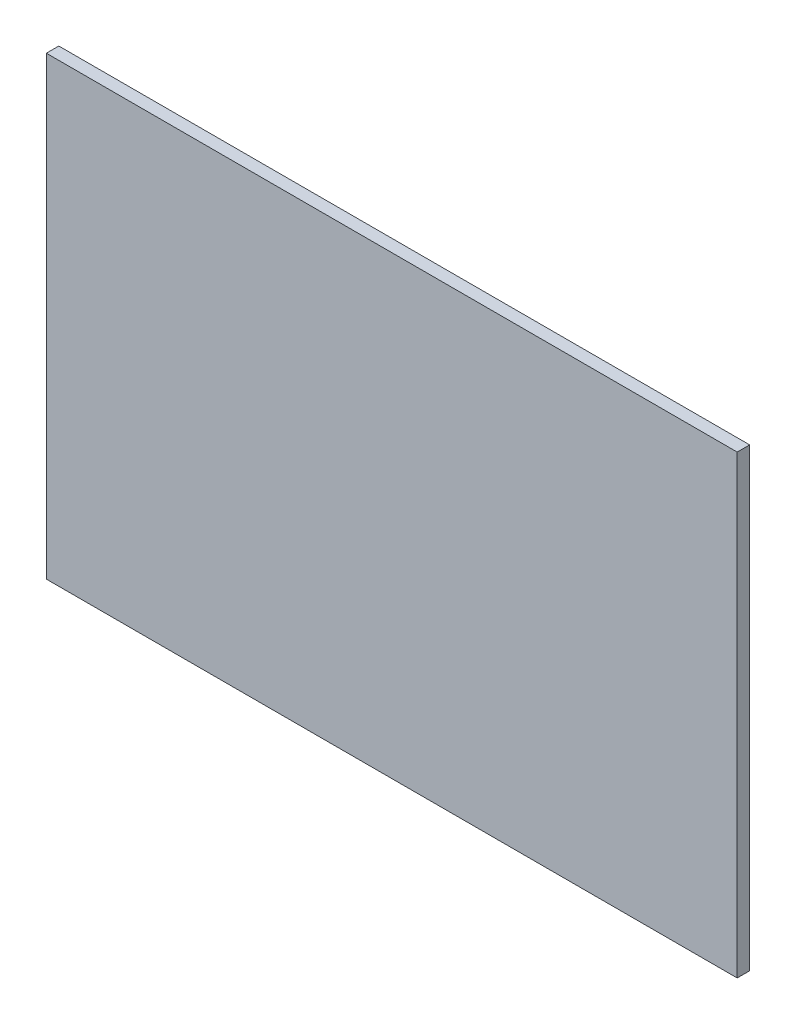
ISO-10303-21;
HEADER;
FILE_DESCRIPTION(('STEP AP214'),'2;1');
FILE_NAME('part.step','',(''),(''),'','','');
FILE_SCHEMA(('AUTOMOTIVE_DESIGN { 1 0 10303 214 1 1 1 1 }'));
ENDSEC;
DATA;
#1=APPLICATION_CONTEXT('core data for automotive mechanical design processes');
#2=APPLICATION_PROTOCOL_DEFINITION('international standard','automotive_design',2000,#1);
#3=PRODUCT_CONTEXT('',#1,'mechanical');
#4=PRODUCT('Part','Part','',(#3));
#5=PRODUCT_RELATED_PRODUCT_CATEGORY('part','',(#4));
#6=PRODUCT_DEFINITION_FORMATION('','',#4);
#7=PRODUCT_DEFINITION_CONTEXT('part definition',#1,'design');
#8=PRODUCT_DEFINITION('design','',#6,#7);
#9=PRODUCT_DEFINITION_SHAPE('','',#8);
#10=(LENGTH_UNIT() NAMED_UNIT(*) SI_UNIT(.MILLI.,.METRE.));
#11=(NAMED_UNIT(*) PLANE_ANGLE_UNIT() SI_UNIT($,.RADIAN.));
#12=(NAMED_UNIT(*) SI_UNIT($,.STERADIAN.) SOLID_ANGLE_UNIT());
#13=UNCERTAINTY_MEASURE_WITH_UNIT(LENGTH_MEASURE(1.E-05),#10,'distance_accuracy_value','');
#14=(GEOMETRIC_REPRESENTATION_CONTEXT(3) GLOBAL_UNCERTAINTY_ASSIGNED_CONTEXT((#13)) GLOBAL_UNIT_ASSIGNED_CONTEXT((#10,
#11,#12)) REPRESENTATION_CONTEXT('',''));
#15=CARTESIAN_POINT('',(0.,0.,0.));
#16=DIRECTION('',(0.,0.,1.));
#17=DIRECTION('',(1.,0.,0.));
#18=AXIS2_PLACEMENT_3D('',#15,#16,#17);
#19=CARTESIAN_POINT('',(0.,60.325,1.65));
#20=DIRECTION('',(0.,1.,0.));
#21=DIRECTION('',(-1.,0.,0.));
#22=AXIS2_PLACEMENT_3D('',#19,#20,#21);
#23=PLANE('',#22);
#24=DIRECTION('',(1.,0.,0.));
#25=VECTOR('',#24,1.);
#26=CARTESIAN_POINT('',(0.,60.325,0.));
#27=LINE('',#26,#25);
#28=CARTESIAN_POINT('',(0.,60.325,0.));
#29=VERTEX_POINT('',#28);
#30=CARTESIAN_POINT('',(91.5,60.325,0.));
#31=VERTEX_POINT('',#30);
#32=EDGE_CURVE('E98',#29,#31,#27,.T.);
#33=ORIENTED_EDGE('',*,*,#32,.F.);
#34=DIRECTION('',(0.,0.,-1.));
#35=VECTOR('',#34,1.);
#36=CARTESIAN_POINT('',(0.,60.325,1.65));
#37=LINE('',#36,#35);
#38=CARTESIAN_POINT('',(0.,60.325,1.65));
#39=VERTEX_POINT('',#38);
#40=EDGE_CURVE('E11',#39,#29,#37,.T.);
#41=ORIENTED_EDGE('',*,*,#40,.F.);
#42=DIRECTION('',(1.,0.,0.));
#43=VECTOR('',#42,1.);
#44=CARTESIAN_POINT('',(0.,60.325,1.65));
#45=LINE('',#44,#43);
#46=CARTESIAN_POINT('',(91.5,60.325,1.65));
#47=VERTEX_POINT('',#46);
#48=EDGE_CURVE('E92',#39,#47,#45,.T.);
#49=ORIENTED_EDGE('',*,*,#48,.T.);
#50=DIRECTION('',(0.,0.,-1.));
#51=VECTOR('',#50,1.);
#52=CARTESIAN_POINT('',(91.5,60.325,1.65));
#53=LINE('',#52,#51);
#54=EDGE_CURVE('E73',#47,#31,#53,.T.);
#55=ORIENTED_EDGE('',*,*,#54,.T.);
#56=EDGE_LOOP('',(#33,#41,#49,#55));
#57=FACE_BOUND('',#56,.T.);
#58=ADVANCED_FACE('F35',(#57),#23,.T.);
#59=CARTESIAN_POINT('',(0.,0.,1.65));
#60=DIRECTION('',(-1.,0.,0.));
#61=DIRECTION('',(0.,0.,1.));
#62=AXIS2_PLACEMENT_3D('',#59,#60,#61);
#63=PLANE('',#62);
#64=DIRECTION('',(0.,1.,0.));
#65=VECTOR('',#64,1.);
#66=CARTESIAN_POINT('',(0.,0.,0.));
#67=LINE('',#66,#65);
#68=CARTESIAN_POINT('',(0.,0.,0.));
#69=VERTEX_POINT('',#68);
#70=EDGE_CURVE('E86',#69,#29,#67,.T.);
#71=ORIENTED_EDGE('',*,*,#70,.F.);
#72=DIRECTION('',(0.,0.,-1.));
#73=VECTOR('',#72,1.);
#74=CARTESIAN_POINT('',(0.,0.,1.65));
#75=LINE('',#74,#73);
#76=CARTESIAN_POINT('',(0.,0.,1.65));
#77=VERTEX_POINT('',#76);
#78=EDGE_CURVE('E43',#77,#69,#75,.T.);
#79=ORIENTED_EDGE('',*,*,#78,.F.);
#80=DIRECTION('',(0.,1.,0.));
#81=VECTOR('',#80,1.);
#82=CARTESIAN_POINT('',(0.,0.,1.65));
#83=LINE('',#82,#81);
#84=EDGE_CURVE('E84',#77,#39,#83,.T.);
#85=ORIENTED_EDGE('',*,*,#84,.T.);
#86=ORIENTED_EDGE('',*,*,#40,.T.);
#87=EDGE_LOOP('',(#71,#79,#85,#86));
#88=FACE_BOUND('',#87,.T.);
#89=ADVANCED_FACE('F82',(#88),#63,.T.);
#90=CARTESIAN_POINT('',(0.,0.,1.65));
#91=DIRECTION('',(0.,1.,0.));
#92=DIRECTION('',(-1.,0.,0.));
#93=AXIS2_PLACEMENT_3D('',#90,#91,#92);
#94=PLANE('',#93);
#95=DIRECTION('',(1.,0.,0.));
#96=VECTOR('',#95,1.);
#97=CARTESIAN_POINT('',(0.,0.,0.));
#98=LINE('',#97,#96);
#99=CARTESIAN_POINT('',(91.5,0.,0.));
#100=VERTEX_POINT('',#99);
#101=EDGE_CURVE('E66',#69,#100,#98,.T.);
#102=ORIENTED_EDGE('',*,*,#101,.T.);
#103=DIRECTION('',(0.,0.,-1.));
#104=VECTOR('',#103,1.);
#105=CARTESIAN_POINT('',(91.5,0.,1.65));
#106=LINE('',#105,#104);
#107=CARTESIAN_POINT('',(91.5,0.,1.65));
#108=VERTEX_POINT('',#107);
#109=EDGE_CURVE('E87',#108,#100,#106,.T.);
#110=ORIENTED_EDGE('',*,*,#109,.F.);
#111=DIRECTION('',(1.,0.,0.));
#112=VECTOR('',#111,1.);
#113=CARTESIAN_POINT('',(0.,0.,1.65));
#114=LINE('',#113,#112);
#115=EDGE_CURVE('E88',#77,#108,#114,.T.);
#116=ORIENTED_EDGE('',*,*,#115,.F.);
#117=ORIENTED_EDGE('',*,*,#78,.T.);
#118=EDGE_LOOP('',(#102,#110,#116,#117));
#119=FACE_BOUND('',#118,.T.);
#120=ADVANCED_FACE('F89',(#119),#94,.F.);
#121=CARTESIAN_POINT('',(91.5,0.,1.65));
#122=DIRECTION('',(-1.,0.,0.));
#123=DIRECTION('',(0.,0.,1.));
#124=AXIS2_PLACEMENT_3D('',#121,#122,#123);
#125=PLANE('',#124);
#126=DIRECTION('',(0.,1.,0.));
#127=VECTOR('',#126,1.);
#128=CARTESIAN_POINT('',(91.5,0.,0.));
#129=LINE('',#128,#127);
#130=EDGE_CURVE('E94',#100,#31,#129,.T.);
#131=ORIENTED_EDGE('',*,*,#130,.T.);
#132=ORIENTED_EDGE('',*,*,#54,.F.);
#133=DIRECTION('',(0.,1.,0.));
#134=VECTOR('',#133,1.);
#135=CARTESIAN_POINT('',(91.5,0.,1.65));
#136=LINE('',#135,#134);
#137=EDGE_CURVE('E51',#108,#47,#136,.T.);
#138=ORIENTED_EDGE('',*,*,#137,.F.);
#139=ORIENTED_EDGE('',*,*,#109,.T.);
#140=EDGE_LOOP('',(#131,#132,#138,#139));
#141=FACE_BOUND('',#140,.T.);
#142=ADVANCED_FACE('F107',(#141),#125,.F.);
#143=CARTESIAN_POINT('',(0.,0.,1.65));
#144=DIRECTION('',(0.,0.,1.));
#145=DIRECTION('',(1.,0.,0.));
#146=AXIS2_PLACEMENT_3D('',#143,#144,#145);
#147=PLANE('',#146);
#148=ORIENTED_EDGE('',*,*,#48,.F.);
#149=ORIENTED_EDGE('',*,*,#84,.F.);
#150=ORIENTED_EDGE('',*,*,#115,.T.);
#151=ORIENTED_EDGE('',*,*,#137,.T.);
#152=EDGE_LOOP('',(#148,#149,#150,#151));
#153=FACE_BOUND('',#152,.T.);
#154=ADVANCED_FACE('F91',(#153),#147,.T.);
#155=CARTESIAN_POINT('',(0.,0.,0.));
#156=DIRECTION('',(0.,0.,1.));
#157=DIRECTION('',(1.,0.,0.));
#158=AXIS2_PLACEMENT_3D('',#155,#156,#157);
#159=PLANE('',#158);
#160=ORIENTED_EDGE('',*,*,#32,.T.);
#161=ORIENTED_EDGE('',*,*,#130,.F.);
#162=ORIENTED_EDGE('',*,*,#101,.F.);
#163=ORIENTED_EDGE('',*,*,#70,.T.);
#164=EDGE_LOOP('',(#160,#161,#162,#163));
#165=FACE_BOUND('',#164,.T.);
#166=ADVANCED_FACE('F109',(#165),#159,.F.);
#167=CLOSED_SHELL('',(#58,#89,#120,#142,#154,#166));
#168=MANIFOLD_SOLID_BREP('B2',#167);
#169=ADVANCED_BREP_SHAPE_REPRESENTATION('',(#18,#168),#14);
#170=SHAPE_DEFINITION_REPRESENTATION(#9,#169);
ENDSEC;
END-ISO-10303-21;
